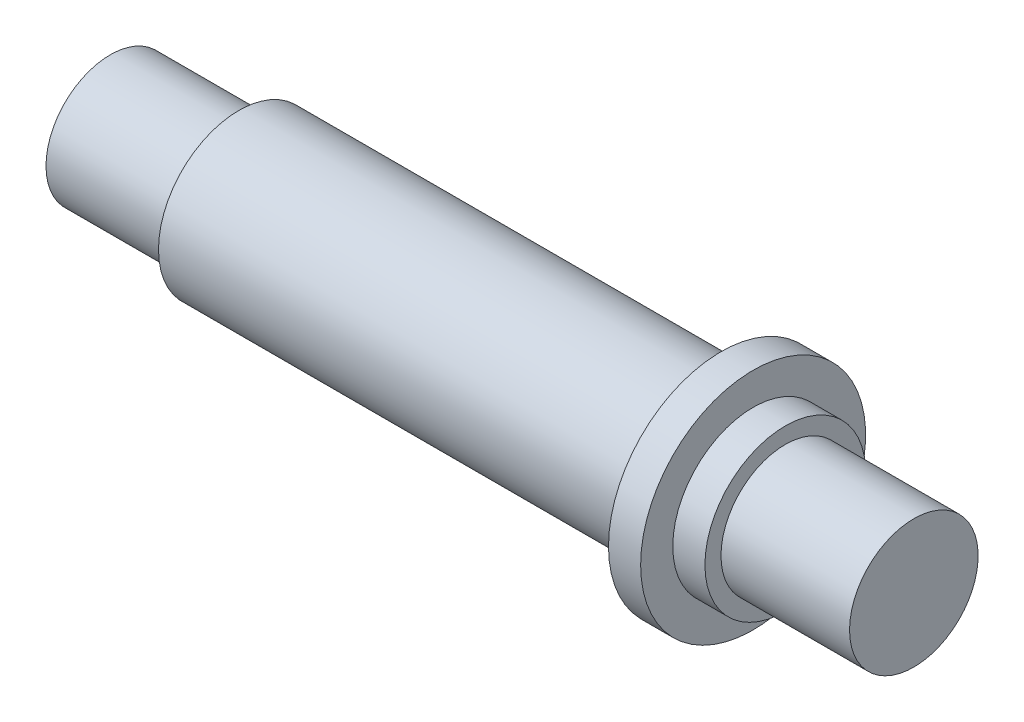
ISO-10303-21;
HEADER;
FILE_DESCRIPTION(('STEP AP214'),'2;1');
FILE_NAME('part.step','',(''),(''),'','','');
FILE_SCHEMA(('AUTOMOTIVE_DESIGN { 1 0 10303 214 1 1 1 1 }'));
ENDSEC;
DATA;
#1=APPLICATION_CONTEXT('core data for automotive mechanical design processes');
#2=APPLICATION_PROTOCOL_DEFINITION('international standard','automotive_design',2000,#1);
#3=PRODUCT_CONTEXT('',#1,'mechanical');
#4=PRODUCT('Part','Part','',(#3));
#5=PRODUCT_RELATED_PRODUCT_CATEGORY('part','',(#4));
#6=PRODUCT_DEFINITION_FORMATION('','',#4);
#7=PRODUCT_DEFINITION_CONTEXT('part definition',#1,'design');
#8=PRODUCT_DEFINITION('design','',#6,#7);
#9=PRODUCT_DEFINITION_SHAPE('','',#8);
#10=(LENGTH_UNIT() NAMED_UNIT(*) SI_UNIT(.MILLI.,.METRE.));
#11=(NAMED_UNIT(*) PLANE_ANGLE_UNIT() SI_UNIT($,.RADIAN.));
#12=(NAMED_UNIT(*) SI_UNIT($,.STERADIAN.) SOLID_ANGLE_UNIT());
#13=UNCERTAINTY_MEASURE_WITH_UNIT(LENGTH_MEASURE(1.E-05),#10,'distance_accuracy_value','');
#14=(GEOMETRIC_REPRESENTATION_CONTEXT(3) GLOBAL_UNCERTAINTY_ASSIGNED_CONTEXT((#13)) GLOBAL_UNIT_ASSIGNED_CONTEXT((#10,
#11,#12)) REPRESENTATION_CONTEXT('',''));
#15=CARTESIAN_POINT('',(0.,0.,0.));
#16=DIRECTION('',(0.,0.,1.));
#17=DIRECTION('',(1.,0.,0.));
#18=AXIS2_PLACEMENT_3D('',#15,#16,#17);
#19=CARTESIAN_POINT('',(-45.1545169204738,0.,0.));
#20=DIRECTION('',(1.,0.,0.));
#21=DIRECTION('',(0.,0.,-1.));
#22=AXIS2_PLACEMENT_3D('',#19,#20,#21);
#23=PLANE('',#22);
#24=CARTESIAN_POINT('',(-45.1545169204738,0.,0.));
#25=DIRECTION('',(-1.,0.,0.));
#26=DIRECTION('',(0.,0.,1.));
#27=AXIS2_PLACEMENT_3D('',#24,#25,#26);
#28=CIRCLE('',#27,2.);
#29=CARTESIAN_POINT('',(-45.1545169204738,0.,2.));
#30=VERTEX_POINT('',#29);
#31=EDGE_CURVE('E10',#30,#30,#28,.T.);
#32=ORIENTED_EDGE('',*,*,#31,.T.);
#33=EDGE_LOOP('',(#32));
#34=FACE_BOUND('',#33,.T.);
#35=ADVANCED_FACE('F30',(#34),#23,.F.);
#36=CARTESIAN_POINT('',(-56.4792208121828,0.,0.));
#37=DIRECTION('',(-1.,0.,0.));
#38=DIRECTION('',(0.,0.,1.));
#39=AXIS2_PLACEMENT_3D('',#36,#37,#38);
#40=CYLINDRICAL_SURFACE('',#39,2.);
#41=ORIENTED_EDGE('',*,*,#31,.F.);
#42=EDGE_LOOP('',(#41));
#43=FACE_BOUND('',#42,.T.);
#44=CARTESIAN_POINT('',(-41.1545169204738,0.,0.));
#45=DIRECTION('',(-1.,0.,0.));
#46=DIRECTION('',(0.,0.,1.));
#47=AXIS2_PLACEMENT_3D('',#44,#45,#46);
#48=CIRCLE('',#47,2.);
#49=CARTESIAN_POINT('',(-41.1545169204738,0.,2.));
#50=VERTEX_POINT('',#49);
#51=EDGE_CURVE('E36',#50,#50,#48,.T.);
#52=ORIENTED_EDGE('',*,*,#51,.T.);
#53=EDGE_LOOP('',(#52));
#54=FACE_BOUND('',#53,.T.);
#55=ADVANCED_FACE('F80',(#43,#54),#40,.T.);
#56=CARTESIAN_POINT('',(-41.1545169204738,2.,0.));
#57=DIRECTION('',(1.,0.,0.));
#58=DIRECTION('',(0.,0.,-1.));
#59=AXIS2_PLACEMENT_3D('',#56,#57,#58);
#60=PLANE('',#59);
#61=ORIENTED_EDGE('',*,*,#51,.F.);
#62=EDGE_LOOP('',(#61));
#63=FACE_BOUND('',#62,.T.);
#64=CARTESIAN_POINT('',(-41.1545169204738,0.,0.));
#65=DIRECTION('',(-1.,0.,0.));
#66=DIRECTION('',(0.,0.,1.));
#67=AXIS2_PLACEMENT_3D('',#64,#65,#66);
#68=CIRCLE('',#67,2.5);
#69=CARTESIAN_POINT('',(-41.1545169204738,0.,2.5));
#70=VERTEX_POINT('',#69);
#71=EDGE_CURVE('E40',#70,#70,#68,.T.);
#72=ORIENTED_EDGE('',*,*,#71,.T.);
#73=EDGE_LOOP('',(#72));
#74=FACE_BOUND('',#73,.T.);
#75=ADVANCED_FACE('F84',(#63,#74),#60,.F.);
#76=CARTESIAN_POINT('',(-56.4792208121828,0.,0.));
#77=DIRECTION('',(-1.,0.,0.));
#78=DIRECTION('',(0.,0.,1.));
#79=AXIS2_PLACEMENT_3D('',#76,#77,#78);
#80=CYLINDRICAL_SURFACE('',#79,2.5);
#81=ORIENTED_EDGE('',*,*,#71,.F.);
#82=EDGE_LOOP('',(#81));
#83=FACE_BOUND('',#82,.T.);
#84=CARTESIAN_POINT('',(-26.1545169204738,0.,0.));
#85=DIRECTION('',(-1.,0.,0.));
#86=DIRECTION('',(0.,0.,1.));
#87=AXIS2_PLACEMENT_3D('',#84,#85,#86);
#88=CIRCLE('',#87,2.5);
#89=CARTESIAN_POINT('',(-26.1545169204738,0.,2.5));
#90=VERTEX_POINT('',#89);
#91=EDGE_CURVE('E44',#90,#90,#88,.T.);
#92=ORIENTED_EDGE('',*,*,#91,.T.);
#93=EDGE_LOOP('',(#92));
#94=FACE_BOUND('',#93,.T.);
#95=ADVANCED_FACE('F89',(#83,#94),#80,.T.);
#96=CARTESIAN_POINT('',(-26.1545169204738,2.5,0.));
#97=DIRECTION('',(1.,0.,0.));
#98=DIRECTION('',(0.,0.,-1.));
#99=AXIS2_PLACEMENT_3D('',#96,#97,#98);
#100=PLANE('',#99);
#101=ORIENTED_EDGE('',*,*,#91,.F.);
#102=EDGE_LOOP('',(#101));
#103=FACE_BOUND('',#102,.T.);
#104=CARTESIAN_POINT('',(-26.1545169204738,0.,0.));
#105=DIRECTION('',(-1.,0.,0.));
#106=DIRECTION('',(0.,0.,1.));
#107=AXIS2_PLACEMENT_3D('',#104,#105,#106);
#108=CIRCLE('',#107,3.5);
#109=CARTESIAN_POINT('',(-26.1545169204738,0.,3.5));
#110=VERTEX_POINT('',#109);
#111=EDGE_CURVE('E49',#110,#110,#108,.T.);
#112=ORIENTED_EDGE('',*,*,#111,.T.);
#113=EDGE_LOOP('',(#112));
#114=FACE_BOUND('',#113,.T.);
#115=ADVANCED_FACE('F95',(#103,#114),#100,.F.);
#116=CARTESIAN_POINT('',(-56.4792208121828,0.,0.));
#117=DIRECTION('',(-1.,0.,0.));
#118=DIRECTION('',(0.,0.,1.));
#119=AXIS2_PLACEMENT_3D('',#116,#117,#118);
#120=CYLINDRICAL_SURFACE('',#119,3.5);
#121=ORIENTED_EDGE('',*,*,#111,.F.);
#122=EDGE_LOOP('',(#121));
#123=FACE_BOUND('',#122,.T.);
#124=CARTESIAN_POINT('',(-25.1545169204738,0.,0.));
#125=DIRECTION('',(-1.,0.,0.));
#126=DIRECTION('',(0.,0.,1.));
#127=AXIS2_PLACEMENT_3D('',#124,#125,#126);
#128=CIRCLE('',#127,3.5);
#129=CARTESIAN_POINT('',(-25.1545169204738,0.,3.5));
#130=VERTEX_POINT('',#129);
#131=EDGE_CURVE('E52',#130,#130,#128,.T.);
#132=ORIENTED_EDGE('',*,*,#131,.T.);
#133=EDGE_LOOP('',(#132));
#134=FACE_BOUND('',#133,.T.);
#135=ADVANCED_FACE('F99',(#123,#134),#120,.T.);
#136=CARTESIAN_POINT('',(-25.1545169204738,3.5,0.));
#137=DIRECTION('',(-1.,0.,0.));
#138=DIRECTION('',(0.,0.,1.));
#139=AXIS2_PLACEMENT_3D('',#136,#137,#138);
#140=PLANE('',#139);
#141=ORIENTED_EDGE('',*,*,#131,.F.);
#142=EDGE_LOOP('',(#141));
#143=FACE_BOUND('',#142,.T.);
#144=CARTESIAN_POINT('',(-25.1545169204738,0.,0.));
#145=DIRECTION('',(-1.,0.,0.));
#146=DIRECTION('',(0.,0.,1.));
#147=AXIS2_PLACEMENT_3D('',#144,#145,#146);
#148=CIRCLE('',#147,2.5);
#149=CARTESIAN_POINT('',(-25.1545169204738,0.,2.5));
#150=VERTEX_POINT('',#149);
#151=EDGE_CURVE('E55',#150,#150,#148,.T.);
#152=ORIENTED_EDGE('',*,*,#151,.T.);
#153=EDGE_LOOP('',(#152));
#154=FACE_BOUND('',#153,.T.);
#155=ADVANCED_FACE('F103',(#143,#154),#140,.F.);
#156=CARTESIAN_POINT('',(-56.4792208121828,0.,0.));
#157=DIRECTION('',(-1.,0.,0.));
#158=DIRECTION('',(0.,0.,1.));
#159=AXIS2_PLACEMENT_3D('',#156,#157,#158);
#160=CYLINDRICAL_SURFACE('',#159,2.5);
#161=ORIENTED_EDGE('',*,*,#151,.F.);
#162=EDGE_LOOP('',(#161));
#163=FACE_BOUND('',#162,.T.);
#164=CARTESIAN_POINT('',(-24.1545169204738,0.,0.));
#165=DIRECTION('',(-1.,0.,0.));
#166=DIRECTION('',(0.,0.,1.));
#167=AXIS2_PLACEMENT_3D('',#164,#165,#166);
#168=CIRCLE('',#167,2.5);
#169=CARTESIAN_POINT('',(-24.1545169204738,0.,2.5));
#170=VERTEX_POINT('',#169);
#171=EDGE_CURVE('E58',#170,#170,#168,.T.);
#172=ORIENTED_EDGE('',*,*,#171,.T.);
#173=EDGE_LOOP('',(#172));
#174=FACE_BOUND('',#173,.T.);
#175=ADVANCED_FACE('F107',(#163,#174),#160,.T.);
#176=CARTESIAN_POINT('',(-24.1545169204738,2.5,0.));
#177=DIRECTION('',(-1.,0.,0.));
#178=DIRECTION('',(0.,0.,1.));
#179=AXIS2_PLACEMENT_3D('',#176,#177,#178);
#180=PLANE('',#179);
#181=ORIENTED_EDGE('',*,*,#171,.F.);
#182=EDGE_LOOP('',(#181));
#183=FACE_BOUND('',#182,.T.);
#184=CARTESIAN_POINT('',(-24.1545169204738,0.,0.));
#185=DIRECTION('',(-1.,0.,0.));
#186=DIRECTION('',(0.,0.,1.));
#187=AXIS2_PLACEMENT_3D('',#184,#185,#186);
#188=CIRCLE('',#187,2.);
#189=CARTESIAN_POINT('',(-24.1545169204738,0.,2.));
#190=VERTEX_POINT('',#189);
#191=EDGE_CURVE('E61',#190,#190,#188,.T.);
#192=ORIENTED_EDGE('',*,*,#191,.T.);
#193=EDGE_LOOP('',(#192));
#194=FACE_BOUND('',#193,.T.);
#195=ADVANCED_FACE('F76',(#183,#194),#180,.F.);
#196=CARTESIAN_POINT('',(-56.4792208121828,0.,0.));
#197=DIRECTION('',(-1.,0.,0.));
#198=DIRECTION('',(0.,0.,1.));
#199=AXIS2_PLACEMENT_3D('',#196,#197,#198);
#200=CYLINDRICAL_SURFACE('',#199,2.);
#201=ORIENTED_EDGE('',*,*,#191,.F.);
#202=EDGE_LOOP('',(#201));
#203=FACE_BOUND('',#202,.T.);
#204=CARTESIAN_POINT('',(-20.1545169204738,0.,0.));
#205=DIRECTION('',(-1.,0.,0.));
#206=DIRECTION('',(0.,0.,1.));
#207=AXIS2_PLACEMENT_3D('',#204,#205,#206);
#208=CIRCLE('',#207,2.);
#209=CARTESIAN_POINT('',(-20.1545169204738,0.,2.));
#210=VERTEX_POINT('',#209);
#211=EDGE_CURVE('E64',#210,#210,#208,.T.);
#212=ORIENTED_EDGE('',*,*,#211,.T.);
#213=EDGE_LOOP('',(#212));
#214=FACE_BOUND('',#213,.T.);
#215=ADVANCED_FACE('F68',(#203,#214),#200,.T.);
#216=CARTESIAN_POINT('',(-20.1545169204738,2.,0.));
#217=DIRECTION('',(-1.,0.,0.));
#218=DIRECTION('',(0.,0.,1.));
#219=AXIS2_PLACEMENT_3D('',#216,#217,#218);
#220=PLANE('',#219);
#221=ORIENTED_EDGE('',*,*,#211,.F.);
#222=EDGE_LOOP('',(#221));
#223=FACE_BOUND('',#222,.T.);
#224=ADVANCED_FACE('F70',(#223),#220,.F.);
#225=CLOSED_SHELL('',(#35,#55,#75,#95,#115,#135,#155,#175,#195,#215,#224));
#226=MANIFOLD_SOLID_BREP('B2',#225);
#227=ADVANCED_BREP_SHAPE_REPRESENTATION('',(#18,#226),#14);
#228=SHAPE_DEFINITION_REPRESENTATION(#9,#227);
ENDSEC;
END-ISO-10303-21;
